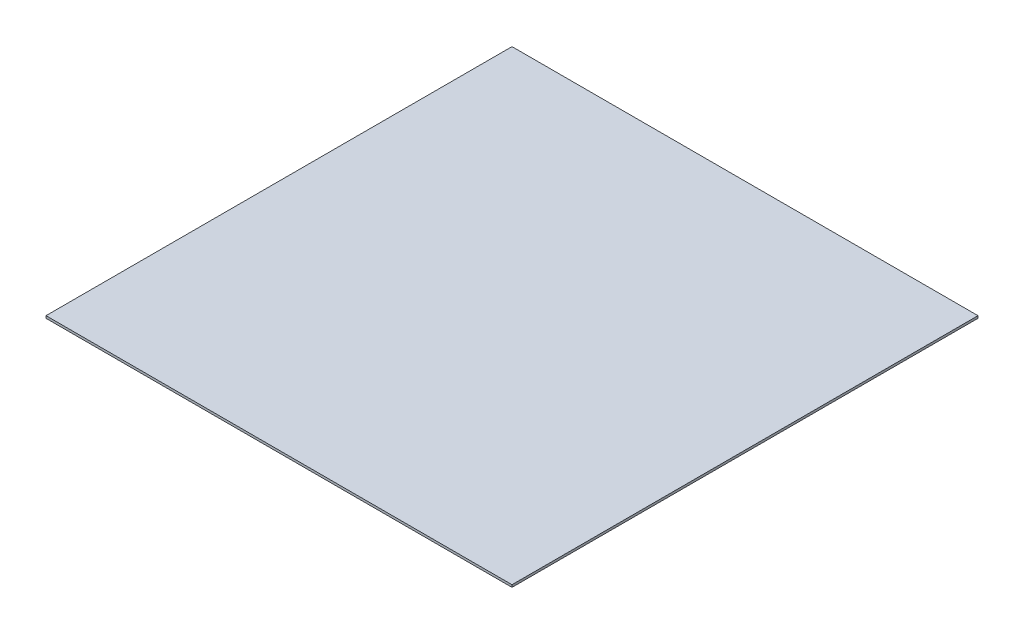
ISO-10303-21;
HEADER;
FILE_DESCRIPTION(('STEP AP214'),'2;1');
FILE_NAME('part.step','',(''),(''),'','','');
FILE_SCHEMA(('AUTOMOTIVE_DESIGN { 1 0 10303 214 1 1 1 1 }'));
ENDSEC;
DATA;
#1=APPLICATION_CONTEXT('core data for automotive mechanical design processes');
#2=APPLICATION_PROTOCOL_DEFINITION('international standard','automotive_design',2000,#1);
#3=PRODUCT_CONTEXT('',#1,'mechanical');
#4=PRODUCT('Part','Part','',(#3));
#5=PRODUCT_RELATED_PRODUCT_CATEGORY('part','',(#4));
#6=PRODUCT_DEFINITION_FORMATION('','',#4);
#7=PRODUCT_DEFINITION_CONTEXT('part definition',#1,'design');
#8=PRODUCT_DEFINITION('design','',#6,#7);
#9=PRODUCT_DEFINITION_SHAPE('','',#8);
#10=(LENGTH_UNIT() NAMED_UNIT(*) SI_UNIT(.MILLI.,.METRE.));
#11=(NAMED_UNIT(*) PLANE_ANGLE_UNIT() SI_UNIT($,.RADIAN.));
#12=(NAMED_UNIT(*) SI_UNIT($,.STERADIAN.) SOLID_ANGLE_UNIT());
#13=UNCERTAINTY_MEASURE_WITH_UNIT(LENGTH_MEASURE(1.E-05),#10,'distance_accuracy_value','');
#14=(GEOMETRIC_REPRESENTATION_CONTEXT(3) GLOBAL_UNCERTAINTY_ASSIGNED_CONTEXT((#13)) GLOBAL_UNIT_ASSIGNED_CONTEXT((#10,
#11,#12)) REPRESENTATION_CONTEXT('',''));
#15=CARTESIAN_POINT('',(0.,0.,0.));
#16=DIRECTION('',(0.,0.,1.));
#17=DIRECTION('',(1.,0.,0.));
#18=AXIS2_PLACEMENT_3D('',#15,#16,#17);
#19=CARTESIAN_POINT('',(-48.6081555886081,10.,-2046.4521486875));
#20=DIRECTION('',(1.,0.,0.));
#21=DIRECTION('',(0.,0.,-1.));
#22=AXIS2_PLACEMENT_3D('',#19,#20,#21);
#23=PLANE('',#22);
#24=DIRECTION('',(0.,0.,1.));
#25=VECTOR('',#24,1.);
#26=CARTESIAN_POINT('',(-48.6081555886081,0.,-2046.4521486875));
#27=LINE('',#26,#25);
#28=CARTESIAN_POINT('',(-48.6081555886081,0.,-2046.4521486875));
#29=VERTEX_POINT('',#28);
#30=CARTESIAN_POINT('',(-48.6081555886079,0.,-46.4521486875003));
#31=VERTEX_POINT('',#30);
#32=EDGE_CURVE('E100',#29,#31,#27,.T.);
#33=ORIENTED_EDGE('',*,*,#32,.T.);
#34=DIRECTION('',(0.,-1.,0.));
#35=VECTOR('',#34,1.);
#36=CARTESIAN_POINT('',(-48.6081555886079,10.,-46.4521486875003));
#37=LINE('',#36,#35);
#38=CARTESIAN_POINT('',(-48.6081555886079,10.,-46.4521486875003));
#39=VERTEX_POINT('',#38);
#40=EDGE_CURVE('E11',#39,#31,#37,.T.);
#41=ORIENTED_EDGE('',*,*,#40,.F.);
#42=DIRECTION('',(0.,0.,1.));
#43=VECTOR('',#42,1.);
#44=CARTESIAN_POINT('',(-48.6081555886081,10.,-2046.4521486875));
#45=LINE('',#44,#43);
#46=CARTESIAN_POINT('',(-48.6081555886081,10.,-2046.4521486875));
#47=VERTEX_POINT('',#46);
#48=EDGE_CURVE('E88',#47,#39,#45,.T.);
#49=ORIENTED_EDGE('',*,*,#48,.F.);
#50=DIRECTION('',(0.,-1.,0.));
#51=VECTOR('',#50,1.);
#52=CARTESIAN_POINT('',(-48.6081555886081,10.,-2046.4521486875));
#53=LINE('',#52,#51);
#54=EDGE_CURVE('E96',#47,#29,#53,.T.);
#55=ORIENTED_EDGE('',*,*,#54,.T.);
#56=EDGE_LOOP('',(#33,#41,#49,#55));
#57=FACE_BOUND('',#56,.T.);
#58=ADVANCED_FACE('F37',(#57),#23,.F.);
#59=CARTESIAN_POINT('',(-48.6081555886079,10.,-46.4521486875003));
#60=DIRECTION('',(0.,0.,-1.));
#61=DIRECTION('',(-1.,0.,0.));
#62=AXIS2_PLACEMENT_3D('',#59,#60,#61);
#63=PLANE('',#62);
#64=DIRECTION('',(1.,0.,0.));
#65=VECTOR('',#64,1.);
#66=CARTESIAN_POINT('',(-48.6081555886079,0.,-46.4521486875003));
#67=LINE('',#66,#65);
#68=CARTESIAN_POINT('',(1951.39184441139,0.,-46.4521486875003));
#69=VERTEX_POINT('',#68);
#70=EDGE_CURVE('E92',#31,#69,#67,.T.);
#71=ORIENTED_EDGE('',*,*,#70,.T.);
#72=DIRECTION('',(0.,-1.,0.));
#73=VECTOR('',#72,1.);
#74=CARTESIAN_POINT('',(1951.39184441139,10.,-46.4521486875003));
#75=LINE('',#74,#73);
#76=CARTESIAN_POINT('',(1951.39184441139,10.,-46.4521486875003));
#77=VERTEX_POINT('',#76);
#78=EDGE_CURVE('E45',#77,#69,#75,.T.);
#79=ORIENTED_EDGE('',*,*,#78,.F.);
#80=DIRECTION('',(1.,0.,0.));
#81=VECTOR('',#80,1.);
#82=CARTESIAN_POINT('',(-48.6081555886079,10.,-46.4521486875003));
#83=LINE('',#82,#81);
#84=EDGE_CURVE('E83',#39,#77,#83,.T.);
#85=ORIENTED_EDGE('',*,*,#84,.F.);
#86=ORIENTED_EDGE('',*,*,#40,.T.);
#87=EDGE_LOOP('',(#71,#79,#85,#86));
#88=FACE_BOUND('',#87,.T.);
#89=ADVANCED_FACE('F91',(#88),#63,.F.);
#90=CARTESIAN_POINT('',(1951.39184441139,10.,-2046.4521486875));
#91=DIRECTION('',(-1.,0.,0.));
#92=DIRECTION('',(0.,0.,1.));
#93=AXIS2_PLACEMENT_3D('',#90,#91,#92);
#94=PLANE('',#93);
#95=DIRECTION('',(0.,0.,-1.));
#96=VECTOR('',#95,1.);
#97=CARTESIAN_POINT('',(1951.39184441139,0.,-2046.4521486875));
#98=LINE('',#97,#96);
#99=CARTESIAN_POINT('',(1951.39184441139,0.,-2046.4521486875));
#100=VERTEX_POINT('',#99);
#101=EDGE_CURVE('E70',#69,#100,#98,.T.);
#102=ORIENTED_EDGE('',*,*,#101,.T.);
#103=DIRECTION('',(0.,-1.,0.));
#104=VECTOR('',#103,1.);
#105=CARTESIAN_POINT('',(1951.39184441139,10.,-2046.4521486875));
#106=LINE('',#105,#104);
#107=CARTESIAN_POINT('',(1951.39184441139,10.,-2046.4521486875));
#108=VERTEX_POINT('',#107);
#109=EDGE_CURVE('E93',#108,#100,#106,.T.);
#110=ORIENTED_EDGE('',*,*,#109,.F.);
#111=DIRECTION('',(0.,0.,-1.));
#112=VECTOR('',#111,1.);
#113=CARTESIAN_POINT('',(1951.39184441139,10.,-2046.4521486875));
#114=LINE('',#113,#112);
#115=EDGE_CURVE('E86',#77,#108,#114,.T.);
#116=ORIENTED_EDGE('',*,*,#115,.F.);
#117=ORIENTED_EDGE('',*,*,#78,.T.);
#118=EDGE_LOOP('',(#102,#110,#116,#117));
#119=FACE_BOUND('',#118,.T.);
#120=ADVANCED_FACE('F94',(#119),#94,.F.);
#121=CARTESIAN_POINT('',(-48.6081555886081,10.,-2046.4521486875));
#122=DIRECTION('',(0.,0.,1.));
#123=DIRECTION('',(1.,0.,0.));
#124=AXIS2_PLACEMENT_3D('',#121,#122,#123);
#125=PLANE('',#124);
#126=DIRECTION('',(-1.,0.,0.));
#127=VECTOR('',#126,1.);
#128=CARTESIAN_POINT('',(-48.6081555886081,0.,-2046.4521486875));
#129=LINE('',#128,#127);
#130=EDGE_CURVE('E76',#100,#29,#129,.T.);
#131=ORIENTED_EDGE('',*,*,#130,.T.);
#132=ORIENTED_EDGE('',*,*,#54,.F.);
#133=DIRECTION('',(-1.,0.,0.));
#134=VECTOR('',#133,1.);
#135=CARTESIAN_POINT('',(-48.6081555886081,10.,-2046.4521486875));
#136=LINE('',#135,#134);
#137=EDGE_CURVE('E53',#108,#47,#136,.T.);
#138=ORIENTED_EDGE('',*,*,#137,.F.);
#139=ORIENTED_EDGE('',*,*,#109,.T.);
#140=EDGE_LOOP('',(#131,#132,#138,#139));
#141=FACE_BOUND('',#140,.T.);
#142=ADVANCED_FACE('F107',(#141),#125,.F.);
#143=CARTESIAN_POINT('',(0.,10.,0.));
#144=DIRECTION('',(0.,1.,0.));
#145=DIRECTION('',(0.,0.,1.));
#146=AXIS2_PLACEMENT_3D('',#143,#144,#145);
#147=PLANE('',#146);
#148=ORIENTED_EDGE('',*,*,#48,.T.);
#149=ORIENTED_EDGE('',*,*,#84,.T.);
#150=ORIENTED_EDGE('',*,*,#115,.T.);
#151=ORIENTED_EDGE('',*,*,#137,.T.);
#152=EDGE_LOOP('',(#148,#149,#150,#151));
#153=FACE_BOUND('',#152,.T.);
#154=ADVANCED_FACE('F84',(#153),#147,.T.);
#155=CARTESIAN_POINT('',(0.,0.,0.));
#156=DIRECTION('',(0.,1.,0.));
#157=DIRECTION('',(0.,0.,1.));
#158=AXIS2_PLACEMENT_3D('',#155,#156,#157);
#159=PLANE('',#158);
#160=ORIENTED_EDGE('',*,*,#32,.F.);
#161=ORIENTED_EDGE('',*,*,#130,.F.);
#162=ORIENTED_EDGE('',*,*,#101,.F.);
#163=ORIENTED_EDGE('',*,*,#70,.F.);
#164=EDGE_LOOP('',(#160,#161,#162,#163));
#165=FACE_BOUND('',#164,.T.);
#166=ADVANCED_FACE('F110',(#165),#159,.F.);
#167=CLOSED_SHELL('',(#58,#89,#120,#142,#154,#166));
#168=MANIFOLD_SOLID_BREP('B2',#167);
#169=ADVANCED_BREP_SHAPE_REPRESENTATION('',(#18,#168),#14);
#170=SHAPE_DEFINITION_REPRESENTATION(#9,#169);
ENDSEC;
END-ISO-10303-21;
